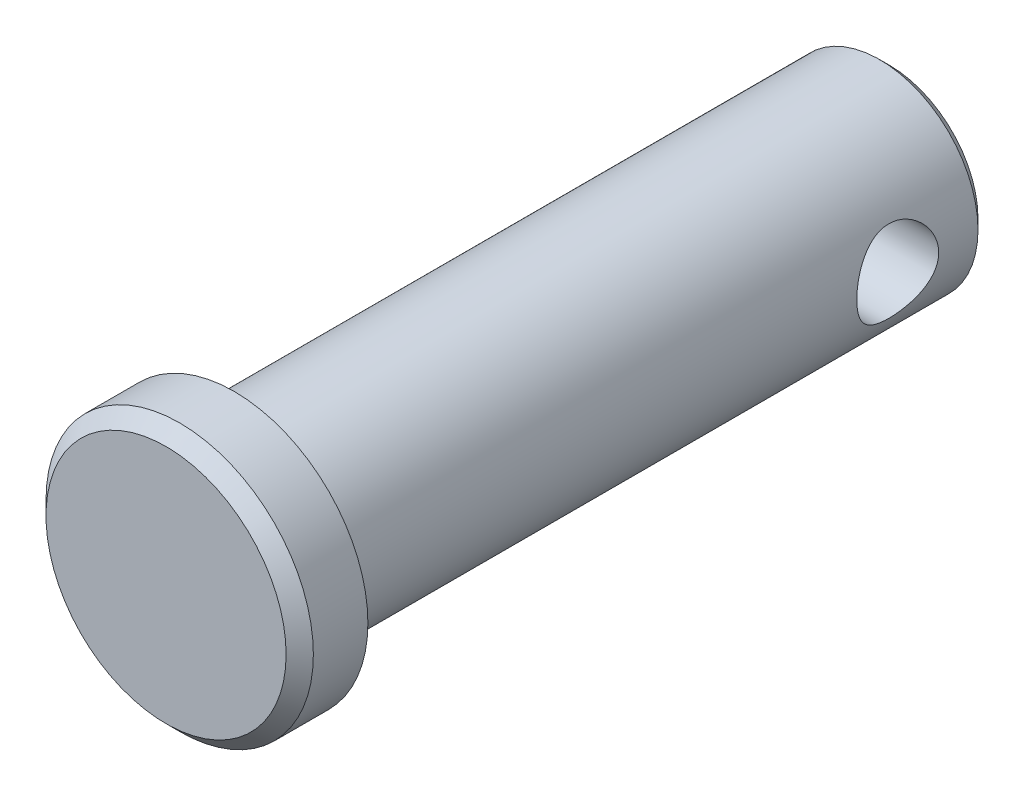
ISO-10303-21;
HEADER;
FILE_DESCRIPTION(('STEP AP214'),'2;1');
FILE_NAME('part.step','',(''),(''),'','','');
FILE_SCHEMA(('AUTOMOTIVE_DESIGN { 1 0 10303 214 1 1 1 1 }'));
ENDSEC;
DATA;
#1=APPLICATION_CONTEXT('core data for automotive mechanical design processes');
#2=APPLICATION_PROTOCOL_DEFINITION('international standard','automotive_design',2000,#1);
#3=PRODUCT_CONTEXT('',#1,'mechanical');
#4=PRODUCT('Part','Part','',(#3));
#5=PRODUCT_RELATED_PRODUCT_CATEGORY('part','',(#4));
#6=PRODUCT_DEFINITION_FORMATION('','',#4);
#7=PRODUCT_DEFINITION_CONTEXT('part definition',#1,'design');
#8=PRODUCT_DEFINITION('design','',#6,#7);
#9=PRODUCT_DEFINITION_SHAPE('','',#8);
#10=(LENGTH_UNIT() NAMED_UNIT(*) SI_UNIT(.MILLI.,.METRE.));
#11=(NAMED_UNIT(*) PLANE_ANGLE_UNIT() SI_UNIT($,.RADIAN.));
#12=(NAMED_UNIT(*) SI_UNIT($,.STERADIAN.) SOLID_ANGLE_UNIT());
#13=UNCERTAINTY_MEASURE_WITH_UNIT(LENGTH_MEASURE(1.E-05),#10,'distance_accuracy_value','');
#14=(GEOMETRIC_REPRESENTATION_CONTEXT(3) GLOBAL_UNCERTAINTY_ASSIGNED_CONTEXT((#13)) GLOBAL_UNIT_ASSIGNED_CONTEXT((#10,
#11,#12)) REPRESENTATION_CONTEXT('',''));
#15=CARTESIAN_POINT('',(0.,0.,0.));
#16=DIRECTION('',(0.,0.,1.));
#17=DIRECTION('',(1.,0.,0.));
#18=AXIS2_PLACEMENT_3D('',#15,#16,#17);
#19=CARTESIAN_POINT('',(0.,0.,15.875));
#20=DIRECTION('',(0.,0.,-1.));
#21=DIRECTION('',(-1.,0.,0.));
#22=AXIS2_PLACEMENT_3D('',#19,#20,#21);
#23=CYLINDRICAL_SURFACE('',#22,4.7625);
#24=CARTESIAN_POINT('',(0.,0.,-15.39875));
#25=DIRECTION('',(0.,0.,1.));
#26=DIRECTION('',(1.,0.,0.));
#27=AXIS2_PLACEMENT_3D('',#24,#25,#26);
#28=CIRCLE('',#27,4.7625);
#29=CARTESIAN_POINT('',(4.7625,0.,-15.39875));
#30=VERTEX_POINT('',#29);
#31=EDGE_CURVE('E37',#30,#30,#28,.T.);
#32=ORIENTED_EDGE('',*,*,#31,.T.);
#33=EDGE_LOOP('',(#32));
#34=FACE_BOUND('',#33,.T.);
#35=CARTESIAN_POINT('',(-4.7625,0.,-9.525));
#36=CARTESIAN_POINT('',(-4.76249140158045,-0.106295908560073,-9.52501143808244));
#37=CARTESIAN_POINT('',(-4.75890007347352,-0.212758967838847,-9.53359148416341));
#38=CARTESIAN_POINT('',(-4.74488118807538,-0.4226677017107,-9.56760701556078));
#39=CARTESIAN_POINT('',(-4.73443579242881,-0.526104765072408,-9.593086485087));
#40=CARTESIAN_POINT('',(-4.70783108848027,-0.726580864674275,-9.65979635820169));
#41=CARTESIAN_POINT('',(-4.69169114960318,-0.823640282526699,-9.70097340578069));
#42=CARTESIAN_POINT('',(-4.65526892272179,-1.00937973872918,-9.7976893568817));
#43=CARTESIAN_POINT('',(-4.63498788984898,-1.0980623041503,-9.85322391011625));
#44=CARTESIAN_POINT('',(-4.59117427508592,-1.26912434065072,-9.98002350986302));
#45=CARTESIAN_POINT('',(-4.56753520905172,-1.35102801218446,-10.0518933277037));
#46=CARTESIAN_POINT('',(-4.52013183583765,-1.50202871598238,-10.2080446314673));
#47=CARTESIAN_POINT('',(-4.4963674694456,-1.57111900525552,-10.29233261077));
#48=CARTESIAN_POINT('',(-4.4500962212813,-1.69789058594091,-10.4759550093843));
#49=CARTESIAN_POINT('',(-4.42770874161498,-1.75484326694356,-10.5758256993771));
#50=CARTESIAN_POINT('',(-4.38841471116746,-1.85092880684824,-10.7847975469495));
#51=CARTESIAN_POINT('',(-4.37150533813807,-1.89007084577611,-10.8938939149316));
#52=CARTESIAN_POINT('',(-4.34623456677981,-1.94745924820552,-11.1127439856816));
#53=CARTESIAN_POINT('',(-4.33750065397212,-1.96662131880699,-11.222212892385));
#54=CARTESIAN_POINT('',(-4.32849855373462,-1.98636270823876,-11.4431338521399));
#55=CARTESIAN_POINT('',(-4.328225697501,-1.98695227536355,-11.5545847775409));
#56=CARTESIAN_POINT('',(-4.33586127302854,-1.97022164952332,-11.7671850959405));
#57=CARTESIAN_POINT('',(-4.34314413823751,-1.95427093765777,-11.8684692407961));
#58=CARTESIAN_POINT('',(-4.36401341403402,-1.90720965737545,-12.0667654444631));
#59=CARTESIAN_POINT('',(-4.37760103179407,-1.87609618568393,-12.1637766812432));
#60=CARTESIAN_POINT('',(-4.40985568326751,-1.79898609480019,-12.3532228534989));
#61=CARTESIAN_POINT('',(-4.42862465094254,-1.75268686068537,-12.4455164807));
#62=CARTESIAN_POINT('',(-4.46910350686474,-1.64673347596642,-12.6213834025347));
#63=CARTESIAN_POINT('',(-4.49081455356025,-1.58707405869977,-12.704953239099));
#64=CARTESIAN_POINT('',(-4.53696350793792,-1.45017484530084,-12.8684336844884));
#65=CARTESIAN_POINT('',(-4.561476802296,-1.37187540459195,-12.9474381757244));
#66=CARTESIAN_POINT('',(-4.6089200606614,-1.20289572579427,-13.0914989359477));
#67=CARTESIAN_POINT('',(-4.63184965292253,-1.11221259562442,-13.1565519375613));
#68=CARTESIAN_POINT('',(-4.67420775145901,-0.918286118550734,-13.2721918699908));
#69=CARTESIAN_POINT('',(-4.69354323137542,-0.814801174635692,-13.3224102441767));
#70=CARTESIAN_POINT('',(-4.72582051746,-0.599840689011345,-13.4044073091202));
#71=CARTESIAN_POINT('',(-4.73876585655208,-0.488369601737118,-13.4361961907108));
#72=CARTESIAN_POINT('',(-4.75614430383386,-0.268173379937138,-13.478535387501));
#73=CARTESIAN_POINT('',(-4.76106396412311,-0.159720415379841,-13.4903017236919));
#74=CARTESIAN_POINT('',(-4.76338979960382,0.05771301560004,-13.4958871299874));
#75=CARTESIAN_POINT('',(-4.76079813192703,0.166693321604807,-13.489711352775));
#76=CARTESIAN_POINT('',(-4.74870808030392,0.376393459717026,-13.4604584028704));
#77=CARTESIAN_POINT('',(-4.73955883563333,0.477254834540024,-13.4382351978707));
#78=CARTESIAN_POINT('',(-4.71564663251208,0.673707613991604,-13.3787067411665));
#79=CARTESIAN_POINT('',(-4.70088296486029,0.769298351097895,-13.3413995840539));
#80=CARTESIAN_POINT('',(-4.666587546492,0.955848037292251,-13.251543576057));
#81=CARTESIAN_POINT('',(-4.64692192707484,1.04657086350782,-13.1985572592557));
#82=CARTESIAN_POINT('',(-4.60492164769306,1.21816211826739,-13.0793277627557));
#83=CARTESIAN_POINT('',(-4.58258587495364,1.29902640975558,-13.0130790481973));
#84=CARTESIAN_POINT('',(-4.53567939534007,1.45467932056039,-12.8636661171801));
#85=CARTESIAN_POINT('',(-4.51106304400759,1.52862073304298,-12.7796313765093));
#86=CARTESIAN_POINT('',(-4.46380134619208,1.66158838069249,-12.5999537244526));
#87=CARTESIAN_POINT('',(-4.44115644808334,1.72061122865917,-12.5043081841649));
#88=CARTESIAN_POINT('',(-4.40025450662331,1.8227033683131,-12.3021499967072));
#89=CARTESIAN_POINT('',(-4.3820645555624,1.86553345201759,-12.1955019686202));
#90=CARTESIAN_POINT('',(-4.35305764608595,1.93226394648122,-11.9755116823265));
#91=CARTESIAN_POINT('',(-4.34223460919757,1.95617996596104,-11.8621750270577));
#92=CARTESIAN_POINT('',(-4.33011523702907,1.98285227553879,-11.6414253150213));
#93=CARTESIAN_POINT('',(-4.32814969660371,1.98709566405842,-11.5342278486105));
#94=CARTESIAN_POINT('',(-4.33218991655001,1.9782722614421,-11.3207119579385));
#95=CARTESIAN_POINT('',(-4.33819445320237,1.96520812768995,-11.214393401252));
#96=CARTESIAN_POINT('',(-4.3568866269235,1.92338967589029,-11.0107527633931));
#97=CARTESIAN_POINT('',(-4.36925013318788,1.89539409419702,-10.9132422808769));
#98=CARTESIAN_POINT('',(-4.39901300153713,1.82524921020888,-10.7242800160954));
#99=CARTESIAN_POINT('',(-4.41641377846563,1.78309593083637,-10.6328299449294));
#100=CARTESIAN_POINT('',(-4.45558790364021,1.68291328922589,-10.4525827651808));
#101=CARTESIAN_POINT('',(-4.47756125557966,1.62408172945392,-10.3642758008578));
#102=CARTESIAN_POINT('',(-4.5228460637297,1.49333596530074,-10.1983220287649));
#103=CARTESIAN_POINT('',(-4.54615798199076,1.42141722463767,-10.1206789337341));
#104=CARTESIAN_POINT('',(-4.59353273649544,1.26031949767388,-9.97243896782547));
#105=CARTESIAN_POINT('',(-4.61752660299969,1.17026489966908,-9.90276716286547));
#106=CARTESIAN_POINT('',(-4.66185477999957,0.978852625814453,-9.7794771174995));
#107=CARTESIAN_POINT('',(-4.68218742117825,0.877489827988871,-9.72586619261284));
#108=CARTESIAN_POINT('',(-4.71660828587906,0.667912140039745,-9.63737937036419));
#109=CARTESIAN_POINT('',(-4.73079417348867,0.559838210681759,-9.60220843299504));
#110=CARTESIAN_POINT('',(-4.75172103007692,0.338789044681412,-9.55086620258894));
#111=CARTESIAN_POINT('',(-4.75848530476497,0.225830315707271,-9.53463542248381));
#112=CARTESIAN_POINT('',(-4.76206006515682,0.0749872800467044,-9.52605860677527));
#113=CARTESIAN_POINT('',(-4.76250303375275,0.0375040440476061,-9.52499596433811));
#114=CARTESIAN_POINT('',(-4.7625,0.,-9.525));
#115=B_SPLINE_CURVE_WITH_KNOTS('',3,(#35,#36,#37,#38,#39,#40,#41,#42,#43,#44,#45,#46,#47,#48,
#49,#50,#51,#52,#53,#54,#55,#56,#57,#58,#59,#60,#61,#62,#63,#64,#65,#66,#67,#68,#69,#70,#71,#72,
#73,#74,#75,#76,#77,#78,#79,#80,#81,#82,#83,#84,#85,#86,#87,#88,#89,#90,#91,#92,#93,#94,#95,#96,
#97,#98,#99,#100,#101,#102,#103,#104,#105,#106,#107,#108,#109,#110,#111,#112,#113,#114),
.UNSPECIFIED.,.T.,.F.,(4,2,2,2,2,2,2,2,2,2,2,2,2,2,2,2,2,2,2,2,2,2,2,2,2,2,2,2,2,2,2,2,2,2,2,2,
2,2,2,4),(0.,0.318780983728252,0.638394933248054,0.95693206490125,1.27537279350409,
1.60842223858481,1.94164645533701,2.29126612705861,2.64070539184808,2.97331246105872,
3.3057359947036,3.61267624559058,3.91967529066949,4.23320706980708,4.54686266326065,
4.88702574040535,5.22726839536907,5.5753643740904,5.92326768446545,6.24916903886785,
6.57497680895409,6.88461586205456,7.19429404105332,7.51359202244554,7.83302353682823,
8.17528349746502,8.5176210971904,8.86483476520742,9.21176159730894,9.53198305625932,
9.85215535434837,10.1574226931906,10.462775857341,10.7864893076844,11.1103151781368,
11.4577262432026,11.8052953096787,12.1471190861327,12.4878663512004,12.6003408219232),.UNSPECIFIED.);
#116=CARTESIAN_POINT('',(-4.7625,0.,-9.525));
#117=VERTEX_POINT('',#116);
#118=EDGE_CURVE('E48',#117,#117,#115,.T.);
#119=ORIENTED_EDGE('',*,*,#118,.T.);
#120=EDGE_LOOP('',(#119));
#121=FACE_BOUND('',#120,.T.);
#122=CARTESIAN_POINT('',(4.7625,0.,-13.49375));
#123=CARTESIAN_POINT('',(4.76249140158045,-0.106295908560073,-13.4937385619176));
#124=CARTESIAN_POINT('',(4.75890007347352,-0.212758967838847,-13.4851585158366));
#125=CARTESIAN_POINT('',(4.74488118807538,-0.4226677017107,-13.4511429844392));
#126=CARTESIAN_POINT('',(4.73443579242881,-0.526104765072408,-13.425663514913));
#127=CARTESIAN_POINT('',(4.70783108848027,-0.726580864674275,-13.3589536417983));
#128=CARTESIAN_POINT('',(4.69169114960318,-0.823640282526699,-13.3177765942193));
#129=CARTESIAN_POINT('',(4.65526892272179,-1.00937973872918,-13.2210606431183));
#130=CARTESIAN_POINT('',(4.63498788984898,-1.0980623041503,-13.1655260898837));
#131=CARTESIAN_POINT('',(4.59117427508592,-1.26912434065072,-13.038726490137));
#132=CARTESIAN_POINT('',(4.56753520905172,-1.35102801218446,-12.9668566722963));
#133=CARTESIAN_POINT('',(4.52013183583765,-1.50202871598238,-12.8107053685327));
#134=CARTESIAN_POINT('',(4.4963674694456,-1.57111900525552,-12.72641738923));
#135=CARTESIAN_POINT('',(4.4500962212813,-1.69789058594091,-12.5427949906157));
#136=CARTESIAN_POINT('',(4.42770874161498,-1.75484326694356,-12.4429243006229));
#137=CARTESIAN_POINT('',(4.38841471116746,-1.85092880684824,-12.2339524530505));
#138=CARTESIAN_POINT('',(4.37150533813807,-1.89007084577611,-12.1248560850684));
#139=CARTESIAN_POINT('',(4.34623456677981,-1.94745924820552,-11.9060060143184));
#140=CARTESIAN_POINT('',(4.33750065397212,-1.96662131880699,-11.796537107615));
#141=CARTESIAN_POINT('',(4.32849855373462,-1.98636270823876,-11.5756161478601));
#142=CARTESIAN_POINT('',(4.328225697501,-1.98695227536355,-11.4641652224591));
#143=CARTESIAN_POINT('',(4.33586127302854,-1.97022164952332,-11.2515649040595));
#144=CARTESIAN_POINT('',(4.34314413823751,-1.95427093765777,-11.1502807592039));
#145=CARTESIAN_POINT('',(4.36401341403402,-1.90720965737545,-10.9519845555369));
#146=CARTESIAN_POINT('',(4.37760103179407,-1.87609618568393,-10.8549733187568));
#147=CARTESIAN_POINT('',(4.40985568326751,-1.79898609480019,-10.6655271465011));
#148=CARTESIAN_POINT('',(4.42862465094254,-1.75268686068537,-10.5732335193));
#149=CARTESIAN_POINT('',(4.46910350686474,-1.64673347596642,-10.3973665974653));
#150=CARTESIAN_POINT('',(4.49081455356025,-1.58707405869977,-10.313796760901));
#151=CARTESIAN_POINT('',(4.53696350793792,-1.45017484530084,-10.1503163155116));
#152=CARTESIAN_POINT('',(4.561476802296,-1.37187540459195,-10.0713118242756));
#153=CARTESIAN_POINT('',(4.6089200606614,-1.20289572579427,-9.9272510640523));
#154=CARTESIAN_POINT('',(4.63184965292253,-1.11221259562442,-9.86219806243867));
#155=CARTESIAN_POINT('',(4.67420775145901,-0.918286118550735,-9.74655813000918));
#156=CARTESIAN_POINT('',(4.69354323137542,-0.814801174635692,-9.69633975582329));
#157=CARTESIAN_POINT('',(4.72582051746,-0.599840689011346,-9.61434269087983));
#158=CARTESIAN_POINT('',(4.73876585655208,-0.488369601737119,-9.58255380928919));
#159=CARTESIAN_POINT('',(4.75614430383386,-0.268173379937138,-9.54021461249897));
#160=CARTESIAN_POINT('',(4.76106396412311,-0.159720415379841,-9.52844827630805));
#161=CARTESIAN_POINT('',(4.76338979960382,0.05771301560004,-9.52286287001263));
#162=CARTESIAN_POINT('',(4.76079813192703,0.166693321604807,-9.52903864722495));
#163=CARTESIAN_POINT('',(4.74870808030392,0.376393459717026,-9.55829159712963));
#164=CARTESIAN_POINT('',(4.73955883563333,0.477254834540023,-9.5805148021293));
#165=CARTESIAN_POINT('',(4.71564663251208,0.673707613991603,-9.6400432588335));
#166=CARTESIAN_POINT('',(4.70088296486029,0.769298351097895,-9.67735041594611));
#167=CARTESIAN_POINT('',(4.666587546492,0.955848037292251,-9.76720642394299));
#168=CARTESIAN_POINT('',(4.64692192707484,1.04657086350782,-9.82019274074433));
#169=CARTESIAN_POINT('',(4.60492164769306,1.21816211826739,-9.93942223724432));
#170=CARTESIAN_POINT('',(4.58258587495364,1.29902640975558,-10.0056709518027));
#171=CARTESIAN_POINT('',(4.53567939534007,1.45467932056039,-10.1550838828199));
#172=CARTESIAN_POINT('',(4.51106304400759,1.52862073304299,-10.2391186234907));
#173=CARTESIAN_POINT('',(4.46380134619208,1.66158838069249,-10.4187962755474));
#174=CARTESIAN_POINT('',(4.44115644808334,1.72061122865917,-10.5144418158351));
#175=CARTESIAN_POINT('',(4.40025450662331,1.8227033683131,-10.7166000032928));
#176=CARTESIAN_POINT('',(4.3820645555624,1.86553345201759,-10.8232480313798));
#177=CARTESIAN_POINT('',(4.35305764608595,1.93226394648122,-11.0432383176735));
#178=CARTESIAN_POINT('',(4.34223460919757,1.95617996596104,-11.1565749729423));
#179=CARTESIAN_POINT('',(4.33011523702907,1.98285227553879,-11.3773246849787));
#180=CARTESIAN_POINT('',(4.32814969660371,1.98709566405842,-11.4845221513895));
#181=CARTESIAN_POINT('',(4.33218991655001,1.9782722614421,-11.6980380420615));
#182=CARTESIAN_POINT('',(4.33819445320237,1.96520812768995,-11.804356598748));
#183=CARTESIAN_POINT('',(4.3568866269235,1.9233896758903,-12.0079972366069));
#184=CARTESIAN_POINT('',(4.36925013318788,1.89539409419702,-12.1055077191231));
#185=CARTESIAN_POINT('',(4.39901300153713,1.82524921020888,-12.2944699839046));
#186=CARTESIAN_POINT('',(4.41641377846563,1.78309593083637,-12.3859200550706));
#187=CARTESIAN_POINT('',(4.45558790364021,1.68291328922589,-12.5661672348192));
#188=CARTESIAN_POINT('',(4.47756125557966,1.62408172945392,-12.6544741991422));
#189=CARTESIAN_POINT('',(4.5228460637297,1.49333596530074,-12.8204279712351));
#190=CARTESIAN_POINT('',(4.54615798199076,1.42141722463767,-12.8980710662659));
#191=CARTESIAN_POINT('',(4.59353273649544,1.26031949767388,-13.0463110321745));
#192=CARTESIAN_POINT('',(4.61752660299969,1.17026489966908,-13.1159828371345));
#193=CARTESIAN_POINT('',(4.66185477999957,0.978852625814453,-13.2392728825005));
#194=CARTESIAN_POINT('',(4.68218742117825,0.877489827988871,-13.2928838073872));
#195=CARTESIAN_POINT('',(4.71660828587906,0.667912140039745,-13.3813706296358));
#196=CARTESIAN_POINT('',(4.73079417348867,0.559838210681759,-13.416541567005));
#197=CARTESIAN_POINT('',(4.75172103007692,0.338789044681412,-13.4678837974111));
#198=CARTESIAN_POINT('',(4.75848530476497,0.225830315707271,-13.4841145775162));
#199=CARTESIAN_POINT('',(4.76206006515682,0.0749872800467044,-13.4926913932247));
#200=CARTESIAN_POINT('',(4.76250303375275,0.0375040440476061,-13.4937540356619));
#201=CARTESIAN_POINT('',(4.7625,0.,-13.49375));
#202=B_SPLINE_CURVE_WITH_KNOTS('',3,(#122,#123,#124,#125,#126,#127,#128,#129,#130,#131,#132,
#133,#134,#135,#136,#137,#138,#139,#140,#141,#142,#143,#144,#145,#146,#147,#148,#149,#150,#151,
#152,#153,#154,#155,#156,#157,#158,#159,#160,#161,#162,#163,#164,#165,#166,#167,#168,#169,#170,
#171,#172,#173,#174,#175,#176,#177,#178,#179,#180,#181,#182,#183,#184,#185,#186,#187,#188,#189,
#190,#191,#192,#193,#194,#195,#196,#197,#198,#199,#200,#201),.UNSPECIFIED.,.T.,.F.,(4,2,2,2,2,2,
2,2,2,2,2,2,2,2,2,2,2,2,2,2,2,2,2,2,2,2,2,2,2,2,2,2,2,2,2,2,2,2,2,4),(0.,0.318780983728252,
0.638394933248054,0.95693206490125,1.27537279350409,1.60842223858481,1.94164645533701,
2.29126612705861,2.64070539184808,2.97331246105872,3.3057359947036,3.61267624559058,
3.91967529066949,4.23320706980708,4.54686266326065,4.88702574040535,5.22726839536907,
5.5753643740904,5.92326768446545,6.24916903886785,6.57497680895409,6.88461586205456,
7.19429404105332,7.51359202244554,7.83302353682823,8.17528349746503,8.5176210971904,
8.86483476520742,9.21176159730894,9.53198305625932,9.85215535434837,10.1574226931906,
10.462775857341,10.7864893076844,11.1103151781368,11.4577262432026,11.8052953096787,
12.1471190861327,12.4878663512004,12.6003408219232),.UNSPECIFIED.);
#203=CARTESIAN_POINT('',(4.7625,0.,-13.49375));
#204=VERTEX_POINT('',#203);
#205=EDGE_CURVE('E56',#204,#204,#202,.T.);
#206=ORIENTED_EDGE('',*,*,#205,.T.);
#207=EDGE_LOOP('',(#206));
#208=FACE_BOUND('',#207,.T.);
#209=CARTESIAN_POINT('',(0.,0.,15.875));
#210=DIRECTION('',(0.,0.,1.));
#211=DIRECTION('',(1.,0.,0.));
#212=AXIS2_PLACEMENT_3D('',#209,#210,#211);
#213=CIRCLE('',#212,4.7625);
#214=CARTESIAN_POINT('',(4.7625,0.,15.875));
#215=VERTEX_POINT('',#214);
#216=EDGE_CURVE('E94',#215,#215,#213,.T.);
#217=ORIENTED_EDGE('',*,*,#216,.F.);
#218=EDGE_LOOP('',(#217));
#219=FACE_BOUND('',#218,.T.);
#220=ADVANCED_FACE('F30',(#34,#121,#208,#219),#23,.T.);
#221=CARTESIAN_POINT('',(0.,0.,-15.875));
#222=DIRECTION('',(0.,0.,1.));
#223=DIRECTION('',(1.,0.,0.));
#224=AXIS2_PLACEMENT_3D('',#221,#222,#223);
#225=PLANE('',#224);
#226=CARTESIAN_POINT('',(0.,0.,-15.875));
#227=DIRECTION('',(0.,0.,1.));
#228=DIRECTION('',(1.,0.,0.));
#229=AXIS2_PLACEMENT_3D('',#226,#227,#228);
#230=CIRCLE('',#229,4.28625000000001);
#231=CARTESIAN_POINT('',(4.28625000000001,0.,-15.875));
#232=VERTEX_POINT('',#231);
#233=EDGE_CURVE('E10',#232,#232,#230,.F.);
#234=ORIENTED_EDGE('',*,*,#233,.T.);
#235=EDGE_LOOP('',(#234));
#236=FACE_BOUND('',#235,.T.);
#237=ADVANCED_FACE('F76',(#236),#225,.F.);
#238=CARTESIAN_POINT('',(0.,0.,15.875));
#239=DIRECTION('',(0.,0.,1.));
#240=DIRECTION('',(1.,0.,0.));
#241=AXIS2_PLACEMENT_3D('',#238,#239,#240);
#242=PLANE('',#241);
#243=CARTESIAN_POINT('',(0.,0.,15.875));
#244=DIRECTION('',(0.,0.,1.));
#245=DIRECTION('',(1.,0.,0.));
#246=AXIS2_PLACEMENT_3D('',#243,#244,#245);
#247=CIRCLE('',#246,6.477);
#248=CARTESIAN_POINT('',(6.477,0.,15.875));
#249=VERTEX_POINT('',#248);
#250=EDGE_CURVE('E55',#249,#249,#247,.T.);
#251=ORIENTED_EDGE('',*,*,#250,.F.);
#252=EDGE_LOOP('',(#251));
#253=FACE_BOUND('',#252,.T.);
#254=ORIENTED_EDGE('',*,*,#216,.T.);
#255=EDGE_LOOP('',(#254));
#256=FACE_BOUND('',#255,.T.);
#257=ADVANCED_FACE('F73',(#253,#256),#242,.F.);
#258=CARTESIAN_POINT('',(0.,0.,19.177));
#259=DIRECTION('',(0.,0.,-1.));
#260=DIRECTION('',(-1.,0.,0.));
#261=AXIS2_PLACEMENT_3D('',#258,#259,#260);
#262=CYLINDRICAL_SURFACE('',#261,6.477);
#263=CARTESIAN_POINT('',(0.,0.,18.5166));
#264=DIRECTION('',(0.,0.,1.));
#265=DIRECTION('',(1.,0.,0.));
#266=AXIS2_PLACEMENT_3D('',#263,#264,#265);
#267=CIRCLE('',#266,6.477);
#268=CARTESIAN_POINT('',(6.477,0.,18.5166));
#269=VERTEX_POINT('',#268);
#270=EDGE_CURVE('E41',#269,#269,#267,.F.);
#271=ORIENTED_EDGE('',*,*,#270,.T.);
#272=EDGE_LOOP('',(#271));
#273=FACE_BOUND('',#272,.T.);
#274=ORIENTED_EDGE('',*,*,#250,.T.);
#275=EDGE_LOOP('',(#274));
#276=FACE_BOUND('',#275,.T.);
#277=ADVANCED_FACE('F71',(#273,#276),#262,.T.);
#278=CARTESIAN_POINT('',(0.,0.,19.177));
#279=DIRECTION('',(0.,0.,1.));
#280=DIRECTION('',(1.,0.,0.));
#281=AXIS2_PLACEMENT_3D('',#278,#279,#280);
#282=PLANE('',#281);
#283=CARTESIAN_POINT('',(0.,0.,19.177));
#284=DIRECTION('',(0.,0.,1.));
#285=DIRECTION('',(1.,0.,0.));
#286=AXIS2_PLACEMENT_3D('',#283,#284,#285);
#287=CIRCLE('',#286,5.81660000000001);
#288=CARTESIAN_POINT('',(5.81660000000001,0.,19.177));
#289=VERTEX_POINT('',#288);
#290=EDGE_CURVE('E45',#289,#289,#287,.T.);
#291=ORIENTED_EDGE('',*,*,#290,.T.);
#292=EDGE_LOOP('',(#291));
#293=FACE_BOUND('',#292,.T.);
#294=ADVANCED_FACE('F67',(#293),#282,.T.);
#295=CARTESIAN_POINT('',(0.,0.,19.177));
#296=DIRECTION('',(0.,0.,-1.));
#297=DIRECTION('',(-1.,0.,0.));
#298=AXIS2_PLACEMENT_3D('',#295,#296,#297);
#299=CONICAL_SURFACE('',#298,5.81660000000001,0.785398163397449);
#300=ORIENTED_EDGE('',*,*,#270,.F.);
#301=EDGE_LOOP('',(#300));
#302=FACE_BOUND('',#301,.T.);
#303=ORIENTED_EDGE('',*,*,#290,.F.);
#304=EDGE_LOOP('',(#303));
#305=FACE_BOUND('',#304,.T.);
#306=ADVANCED_FACE('F65',(#302,#305),#299,.T.);
#307=CARTESIAN_POINT('',(-6.477,0.,-11.509375));
#308=DIRECTION('',(1.,0.,0.));
#309=DIRECTION('',(0.,0.,-1.));
#310=AXIS2_PLACEMENT_3D('',#307,#308,#309);
#311=CYLINDRICAL_SURFACE('',#310,1.984375);
#312=ORIENTED_EDGE('',*,*,#205,.F.);
#313=EDGE_LOOP('',(#312));
#314=FACE_BOUND('',#313,.T.);
#315=ORIENTED_EDGE('',*,*,#118,.F.);
#316=EDGE_LOOP('',(#315));
#317=FACE_BOUND('',#316,.T.);
#318=ADVANCED_FACE('F61',(#314,#317),#311,.F.);
#319=CARTESIAN_POINT('',(0.,0.,-15.39875));
#320=DIRECTION('',(0.,0.,1.));
#321=DIRECTION('',(1.,0.,0.));
#322=AXIS2_PLACEMENT_3D('',#319,#320,#321);
#323=CONICAL_SURFACE('',#322,4.7625,0.785398163397446);
#324=ORIENTED_EDGE('',*,*,#233,.F.);
#325=EDGE_LOOP('',(#324));
#326=FACE_BOUND('',#325,.T.);
#327=ORIENTED_EDGE('',*,*,#31,.F.);
#328=EDGE_LOOP('',(#327));
#329=FACE_BOUND('',#328,.T.);
#330=ADVANCED_FACE('F32',(#326,#329),#323,.T.);
#331=CLOSED_SHELL('',(#220,#237,#257,#277,#294,#306,#318,#330));
#332=MANIFOLD_SOLID_BREP('B2',#331);
#333=ADVANCED_BREP_SHAPE_REPRESENTATION('',(#18,#332),#14);
#334=SHAPE_DEFINITION_REPRESENTATION(#9,#333);
ENDSEC;
END-ISO-10303-21;
